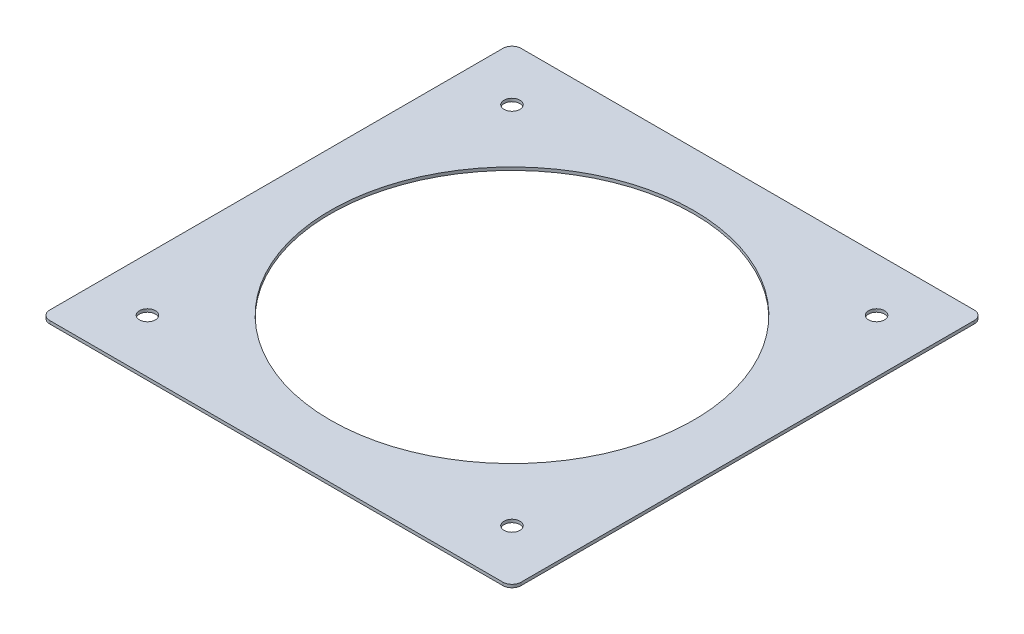
ISO-10303-21;
HEADER;
FILE_DESCRIPTION(('STEP AP214'),'2;1');
FILE_NAME('part.step','',(''),(''),'','','');
FILE_SCHEMA(('AUTOMOTIVE_DESIGN { 1 0 10303 214 1 1 1 1 }'));
ENDSEC;
DATA;
#1=APPLICATION_CONTEXT('core data for automotive mechanical design processes');
#2=APPLICATION_PROTOCOL_DEFINITION('international standard','automotive_design',2000,#1);
#3=PRODUCT_CONTEXT('',#1,'mechanical');
#4=PRODUCT('Part','Part','',(#3));
#5=PRODUCT_RELATED_PRODUCT_CATEGORY('part','',(#4));
#6=PRODUCT_DEFINITION_FORMATION('','',#4);
#7=PRODUCT_DEFINITION_CONTEXT('part definition',#1,'design');
#8=PRODUCT_DEFINITION('design','',#6,#7);
#9=PRODUCT_DEFINITION_SHAPE('','',#8);
#10=(LENGTH_UNIT() NAMED_UNIT(*) SI_UNIT(.MILLI.,.METRE.));
#11=(NAMED_UNIT(*) PLANE_ANGLE_UNIT() SI_UNIT($,.RADIAN.));
#12=(NAMED_UNIT(*) SI_UNIT($,.STERADIAN.) SOLID_ANGLE_UNIT());
#13=UNCERTAINTY_MEASURE_WITH_UNIT(LENGTH_MEASURE(1.E-05),#10,'distance_accuracy_value','');
#14=(GEOMETRIC_REPRESENTATION_CONTEXT(3) GLOBAL_UNCERTAINTY_ASSIGNED_CONTEXT((#13)) GLOBAL_UNIT_ASSIGNED_CONTEXT((#10,
#11,#12)) REPRESENTATION_CONTEXT('',''));
#15=CARTESIAN_POINT('',(0.,0.,0.));
#16=DIRECTION('',(0.,0.,1.));
#17=DIRECTION('',(1.,0.,0.));
#18=AXIS2_PLACEMENT_3D('',#15,#16,#17);
#19=CARTESIAN_POINT('',(77.4590674313275,1.,0.));
#20=DIRECTION('',(-1.,0.,0.));
#21=DIRECTION('',(0.,0.,1.));
#22=AXIS2_PLACEMENT_3D('',#19,#20,#21);
#23=PLANE('',#22);
#24=DIRECTION('',(0.,0.,-1.));
#25=VECTOR('',#24,1.);
#26=CARTESIAN_POINT('',(77.4590674313275,0.,0.));
#27=LINE('',#26,#25);
#28=CARTESIAN_POINT('',(77.4590674313275,0.,74.0531285438933));
#29=VERTEX_POINT('',#28);
#30=CARTESIAN_POINT('',(77.4590674313275,0.,-75.6224732138146));
#31=VERTEX_POINT('',#30);
#32=EDGE_CURVE('E155',#29,#31,#27,.T.);
#33=ORIENTED_EDGE('',*,*,#32,.T.);
#34=DIRECTION('',(0.,-1.,0.));
#35=VECTOR('',#34,1.);
#36=CARTESIAN_POINT('',(77.4590674313275,1.,-75.6224732138146));
#37=LINE('',#36,#35);
#38=CARTESIAN_POINT('',(77.4590674313275,1.,-75.6224732138146));
#39=VERTEX_POINT('',#38);
#40=EDGE_CURVE('E11',#39,#31,#37,.T.);
#41=ORIENTED_EDGE('',*,*,#40,.F.);
#42=DIRECTION('',(0.,0.,-1.));
#43=VECTOR('',#42,1.);
#44=CARTESIAN_POINT('',(77.4590674313275,1.,0.));
#45=LINE('',#44,#43);
#46=CARTESIAN_POINT('',(77.4590674313275,1.,74.0531285438933));
#47=VERTEX_POINT('',#46);
#48=EDGE_CURVE('E208',#47,#39,#45,.T.);
#49=ORIENTED_EDGE('',*,*,#48,.F.);
#50=DIRECTION('',(0.,-1.,0.));
#51=VECTOR('',#50,1.);
#52=CARTESIAN_POINT('',(77.4590674313275,1.,74.0531285438933));
#53=LINE('',#52,#51);
#54=EDGE_CURVE('E145',#47,#29,#53,.T.);
#55=ORIENTED_EDGE('',*,*,#54,.T.);
#56=EDGE_LOOP('',(#33,#41,#49,#55));
#57=FACE_BOUND('',#56,.T.);
#58=ADVANCED_FACE('F42',(#57),#23,.F.);
#59=CARTESIAN_POINT('',(74.4454647113736,1.,-75.6224732138146));
#60=DIRECTION('',(0.,-1.,0.));
#61=DIRECTION('',(0.,0.,-1.));
#62=AXIS2_PLACEMENT_3D('',#59,#60,#61);
#63=CYLINDRICAL_SURFACE('',#62,3.01360271995386);
#64=CARTESIAN_POINT('',(74.4454647113736,0.,-75.6224732138146));
#65=DIRECTION('',(0.,1.,0.));
#66=DIRECTION('',(0.,0.,1.));
#67=AXIS2_PLACEMENT_3D('',#64,#65,#66);
#68=CIRCLE('',#67,3.01360271995386);
#69=CARTESIAN_POINT('',(74.4454647113736,0.,-78.6360759337684));
#70=VERTEX_POINT('',#69);
#71=EDGE_CURVE('E158',#31,#70,#68,.T.);
#72=ORIENTED_EDGE('',*,*,#71,.T.);
#73=DIRECTION('',(0.,-1.,0.));
#74=VECTOR('',#73,1.);
#75=CARTESIAN_POINT('',(74.4454647113736,1.,-78.6360759337684));
#76=LINE('',#75,#74);
#77=CARTESIAN_POINT('',(74.4454647113736,1.,-78.6360759337684));
#78=VERTEX_POINT('',#77);
#79=EDGE_CURVE('E51',#78,#70,#76,.T.);
#80=ORIENTED_EDGE('',*,*,#79,.F.);
#81=CARTESIAN_POINT('',(74.4454647113736,1.,-75.6224732138146));
#82=DIRECTION('',(0.,1.,0.));
#83=DIRECTION('',(0.,0.,1.));
#84=AXIS2_PLACEMENT_3D('',#81,#82,#83);
#85=CIRCLE('',#84,3.01360271995386);
#86=EDGE_CURVE('E102',#39,#78,#85,.T.);
#87=ORIENTED_EDGE('',*,*,#86,.F.);
#88=ORIENTED_EDGE('',*,*,#40,.T.);
#89=EDGE_LOOP('',(#72,#80,#87,#88));
#90=FACE_BOUND('',#89,.T.);
#91=ADVANCED_FACE('F245',(#90),#63,.T.);
#92=CARTESIAN_POINT('',(0.,1.,-78.6360759337684));
#93=DIRECTION('',(0.,0.,1.));
#94=DIRECTION('',(1.,0.,0.));
#95=AXIS2_PLACEMENT_3D('',#92,#93,#94);
#96=PLANE('',#95);
#97=DIRECTION('',(-1.,0.,0.));
#98=VECTOR('',#97,1.);
#99=CARTESIAN_POINT('',(0.,0.,-78.6360759337684));
#100=LINE('',#99,#98);
#101=CARTESIAN_POINT('',(-75.2301370463343,0.,-78.6360759337684));
#102=VERTEX_POINT('',#101);
#103=EDGE_CURVE('E160',#70,#102,#100,.T.);
#104=ORIENTED_EDGE('',*,*,#103,.T.);
#105=DIRECTION('',(0.,-1.,0.));
#106=VECTOR('',#105,1.);
#107=CARTESIAN_POINT('',(-75.2301370463343,1.,-78.6360759337684));
#108=LINE('',#107,#106);
#109=CARTESIAN_POINT('',(-75.2301370463343,1.,-78.6360759337684));
#110=VERTEX_POINT('',#109);
#111=EDGE_CURVE('E182',#110,#102,#108,.T.);
#112=ORIENTED_EDGE('',*,*,#111,.F.);
#113=DIRECTION('',(-1.,0.,0.));
#114=VECTOR('',#113,1.);
#115=CARTESIAN_POINT('',(0.,1.,-78.6360759337684));
#116=LINE('',#115,#114);
#117=EDGE_CURVE('E190',#78,#110,#116,.T.);
#118=ORIENTED_EDGE('',*,*,#117,.F.);
#119=ORIENTED_EDGE('',*,*,#79,.T.);
#120=EDGE_LOOP('',(#104,#112,#118,#119));
#121=FACE_BOUND('',#120,.T.);
#122=ADVANCED_FACE('F188',(#121),#96,.F.);
#123=CARTESIAN_POINT('',(-75.2301370463343,1.,-75.6224732138146));
#124=DIRECTION('',(0.,-1.,0.));
#125=DIRECTION('',(0.,0.,-1.));
#126=AXIS2_PLACEMENT_3D('',#123,#124,#125);
#127=CYLINDRICAL_SURFACE('',#126,3.01360271995386);
#128=CARTESIAN_POINT('',(-75.2301370463343,0.,-75.6224732138146));
#129=DIRECTION('',(0.,1.,0.));
#130=DIRECTION('',(0.,0.,1.));
#131=AXIS2_PLACEMENT_3D('',#128,#129,#130);
#132=CIRCLE('',#131,3.01360271995386);
#133=CARTESIAN_POINT('',(-78.2437397662881,0.,-75.6224732138146));
#134=VERTEX_POINT('',#133);
#135=EDGE_CURVE('E162',#102,#134,#132,.T.);
#136=ORIENTED_EDGE('',*,*,#135,.T.);
#137=DIRECTION('',(0.,-1.,0.));
#138=VECTOR('',#137,1.);
#139=CARTESIAN_POINT('',(-78.2437397662881,1.,-75.6224732138146));
#140=LINE('',#139,#138);
#141=CARTESIAN_POINT('',(-78.2437397662881,1.,-75.6224732138146));
#142=VERTEX_POINT('',#141);
#143=EDGE_CURVE('E179',#142,#134,#140,.T.);
#144=ORIENTED_EDGE('',*,*,#143,.F.);
#145=CARTESIAN_POINT('',(-75.2301370463343,1.,-75.6224732138146));
#146=DIRECTION('',(0.,1.,0.));
#147=DIRECTION('',(0.,0.,1.));
#148=AXIS2_PLACEMENT_3D('',#145,#146,#147);
#149=CIRCLE('',#148,3.01360271995386);
#150=EDGE_CURVE('E203',#110,#142,#149,.T.);
#151=ORIENTED_EDGE('',*,*,#150,.F.);
#152=ORIENTED_EDGE('',*,*,#111,.T.);
#153=EDGE_LOOP('',(#136,#144,#151,#152));
#154=FACE_BOUND('',#153,.T.);
#155=ADVANCED_FACE('F199',(#154),#127,.T.);
#156=CARTESIAN_POINT('',(-78.2437397662881,1.,0.));
#157=DIRECTION('',(1.,0.,0.));
#158=DIRECTION('',(0.,0.,-1.));
#159=AXIS2_PLACEMENT_3D('',#156,#157,#158);
#160=PLANE('',#159);
#161=DIRECTION('',(0.,0.,1.));
#162=VECTOR('',#161,1.);
#163=CARTESIAN_POINT('',(-78.2437397662881,0.,0.));
#164=LINE('',#163,#162);
#165=CARTESIAN_POINT('',(-78.2437397662881,0.,74.0531285438933));
#166=VERTEX_POINT('',#165);
#167=EDGE_CURVE('E164',#134,#166,#164,.T.);
#168=ORIENTED_EDGE('',*,*,#167,.T.);
#169=DIRECTION('',(0.,-1.,0.));
#170=VECTOR('',#169,1.);
#171=CARTESIAN_POINT('',(-78.2437397662881,1.,74.0531285438933));
#172=LINE('',#171,#170);
#173=CARTESIAN_POINT('',(-78.2437397662881,1.,74.0531285438933));
#174=VERTEX_POINT('',#173);
#175=EDGE_CURVE('E131',#174,#166,#172,.T.);
#176=ORIENTED_EDGE('',*,*,#175,.F.);
#177=DIRECTION('',(0.,0.,1.));
#178=VECTOR('',#177,1.);
#179=CARTESIAN_POINT('',(-78.2437397662881,1.,0.));
#180=LINE('',#179,#178);
#181=EDGE_CURVE('E122',#142,#174,#180,.T.);
#182=ORIENTED_EDGE('',*,*,#181,.F.);
#183=ORIENTED_EDGE('',*,*,#143,.T.);
#184=EDGE_LOOP('',(#168,#176,#182,#183));
#185=FACE_BOUND('',#184,.T.);
#186=ADVANCED_FACE('F202',(#185),#160,.F.);
#187=CARTESIAN_POINT('',(-75.2301370463343,1.,74.0531285438933));
#188=DIRECTION('',(0.,-1.,0.));
#189=DIRECTION('',(0.,0.,-1.));
#190=AXIS2_PLACEMENT_3D('',#187,#188,#189);
#191=CYLINDRICAL_SURFACE('',#190,3.01360271995385);
#192=CARTESIAN_POINT('',(-75.2301370463343,0.,74.0531285438933));
#193=DIRECTION('',(0.,1.,0.));
#194=DIRECTION('',(0.,0.,1.));
#195=AXIS2_PLACEMENT_3D('',#192,#193,#194);
#196=CIRCLE('',#195,3.01360271995385);
#197=CARTESIAN_POINT('',(-75.2301370463343,0.,77.0667312638472));
#198=VERTEX_POINT('',#197);
#199=EDGE_CURVE('E130',#166,#198,#196,.T.);
#200=ORIENTED_EDGE('',*,*,#199,.T.);
#201=DIRECTION('',(0.,-1.,0.));
#202=VECTOR('',#201,1.);
#203=CARTESIAN_POINT('',(-75.2301370463343,1.,77.0667312638472));
#204=LINE('',#203,#202);
#205=CARTESIAN_POINT('',(-75.2301370463343,1.,77.0667312638472));
#206=VERTEX_POINT('',#205);
#207=EDGE_CURVE('E127',#206,#198,#204,.T.);
#208=ORIENTED_EDGE('',*,*,#207,.F.);
#209=CARTESIAN_POINT('',(-75.2301370463343,1.,74.0531285438933));
#210=DIRECTION('',(0.,1.,0.));
#211=DIRECTION('',(0.,0.,1.));
#212=AXIS2_PLACEMENT_3D('',#209,#210,#211);
#213=CIRCLE('',#212,3.01360271995385);
#214=EDGE_CURVE('E115',#174,#206,#213,.T.);
#215=ORIENTED_EDGE('',*,*,#214,.F.);
#216=ORIENTED_EDGE('',*,*,#175,.T.);
#217=EDGE_LOOP('',(#200,#208,#215,#216));
#218=FACE_BOUND('',#217,.T.);
#219=ADVANCED_FACE('F128',(#218),#191,.T.);
#220=CARTESIAN_POINT('',(0.,1.,77.0667312638472));
#221=DIRECTION('',(0.,0.,-1.));
#222=DIRECTION('',(-1.,0.,0.));
#223=AXIS2_PLACEMENT_3D('',#220,#221,#222);
#224=PLANE('',#223);
#225=DIRECTION('',(1.,0.,0.));
#226=VECTOR('',#225,1.);
#227=CARTESIAN_POINT('',(0.,0.,77.0667312638472));
#228=LINE('',#227,#226);
#229=CARTESIAN_POINT('',(74.4454647113736,0.,77.0667312638472));
#230=VERTEX_POINT('',#229);
#231=EDGE_CURVE('E88',#198,#230,#228,.T.);
#232=ORIENTED_EDGE('',*,*,#231,.T.);
#233=DIRECTION('',(0.,-1.,0.));
#234=VECTOR('',#233,1.);
#235=CARTESIAN_POINT('',(74.4454647113736,1.,77.0667312638472));
#236=LINE('',#235,#234);
#237=CARTESIAN_POINT('',(74.4454647113736,1.,77.0667312638472));
#238=VERTEX_POINT('',#237);
#239=EDGE_CURVE('E132',#238,#230,#236,.T.);
#240=ORIENTED_EDGE('',*,*,#239,.F.);
#241=DIRECTION('',(1.,0.,0.));
#242=VECTOR('',#241,1.);
#243=CARTESIAN_POINT('',(0.,1.,77.0667312638472));
#244=LINE('',#243,#242);
#245=EDGE_CURVE('E120',#206,#238,#244,.T.);
#246=ORIENTED_EDGE('',*,*,#245,.F.);
#247=ORIENTED_EDGE('',*,*,#207,.T.);
#248=EDGE_LOOP('',(#232,#240,#246,#247));
#249=FACE_BOUND('',#248,.T.);
#250=ADVANCED_FACE('F134',(#249),#224,.F.);
#251=CARTESIAN_POINT('',(59.8214251180902,1.,59.42908895061));
#252=DIRECTION('',(0.,-1.,0.));
#253=DIRECTION('',(0.,0.,-1.));
#254=AXIS2_PLACEMENT_3D('',#251,#252,#253);
#255=CYLINDRICAL_SURFACE('',#254,2.63764231323723);
#256=CARTESIAN_POINT('',(59.8214251180902,1.,59.42908895061));
#257=DIRECTION('',(0.,1.,0.));
#258=DIRECTION('',(0.,0.,1.));
#259=AXIS2_PLACEMENT_3D('',#256,#257,#258);
#260=CIRCLE('',#259,2.63764231323723);
#261=CARTESIAN_POINT('',(59.8214251180902,1.,62.0667312638472));
#262=VERTEX_POINT('',#261);
#263=EDGE_CURVE('E136',#262,#262,#260,.T.);
#264=ORIENTED_EDGE('',*,*,#263,.T.);
#265=EDGE_LOOP('',(#264));
#266=FACE_BOUND('',#265,.T.);
#267=CARTESIAN_POINT('',(59.8214251180902,0.,59.42908895061));
#268=DIRECTION('',(0.,1.,0.));
#269=DIRECTION('',(0.,0.,1.));
#270=AXIS2_PLACEMENT_3D('',#267,#268,#269);
#271=CIRCLE('',#270,2.63764231323723);
#272=CARTESIAN_POINT('',(59.8214251180902,0.,62.0667312638472));
#273=VERTEX_POINT('',#272);
#274=EDGE_CURVE('E169',#273,#273,#271,.T.);
#275=ORIENTED_EDGE('',*,*,#274,.F.);
#276=EDGE_LOOP('',(#275));
#277=FACE_BOUND('',#276,.T.);
#278=ADVANCED_FACE('F269',(#266,#277),#255,.F.);
#279=CARTESIAN_POINT('',(74.4454647113736,1.,74.0531285438933));
#280=DIRECTION('',(0.,-1.,0.));
#281=DIRECTION('',(0.,0.,-1.));
#282=AXIS2_PLACEMENT_3D('',#279,#280,#281);
#283=CYLINDRICAL_SURFACE('',#282,3.01360271995386);
#284=CARTESIAN_POINT('',(74.4454647113736,0.,74.0531285438933));
#285=DIRECTION('',(0.,1.,0.));
#286=DIRECTION('',(0.,0.,1.));
#287=AXIS2_PLACEMENT_3D('',#284,#285,#286);
#288=CIRCLE('',#287,3.01360271995386);
#289=EDGE_CURVE('E94',#230,#29,#288,.T.);
#290=ORIENTED_EDGE('',*,*,#289,.T.);
#291=ORIENTED_EDGE('',*,*,#54,.F.);
#292=CARTESIAN_POINT('',(74.4454647113736,1.,74.0531285438933));
#293=DIRECTION('',(0.,1.,0.));
#294=DIRECTION('',(0.,0.,1.));
#295=AXIS2_PLACEMENT_3D('',#292,#293,#294);
#296=CIRCLE('',#295,3.01360271995386);
#297=EDGE_CURVE('E59',#238,#47,#296,.T.);
#298=ORIENTED_EDGE('',*,*,#297,.F.);
#299=ORIENTED_EDGE('',*,*,#239,.T.);
#300=EDGE_LOOP('',(#290,#291,#298,#299));
#301=FACE_BOUND('',#300,.T.);
#302=ADVANCED_FACE('F233',(#301),#283,.T.);
#303=CARTESIAN_POINT('',(-60.6060974530509,1.,-60.9984336205312));
#304=DIRECTION('',(0.,-1.,0.));
#305=DIRECTION('',(0.,0.,-1.));
#306=AXIS2_PLACEMENT_3D('',#303,#304,#305);
#307=CYLINDRICAL_SURFACE('',#306,2.63764231323724);
#308=CARTESIAN_POINT('',(-60.6060974530509,1.,-60.9984336205312));
#309=DIRECTION('',(0.,1.,0.));
#310=DIRECTION('',(0.,0.,1.));
#311=AXIS2_PLACEMENT_3D('',#308,#309,#310);
#312=CIRCLE('',#311,2.63764231323724);
#313=CARTESIAN_POINT('',(-60.6060974530509,1.,-58.360791307294));
#314=VERTEX_POINT('',#313);
#315=EDGE_CURVE('E210',#314,#314,#312,.T.);
#316=ORIENTED_EDGE('',*,*,#315,.T.);
#317=EDGE_LOOP('',(#316));
#318=FACE_BOUND('',#317,.T.);
#319=CARTESIAN_POINT('',(-60.6060974530509,0.,-60.9984336205312));
#320=DIRECTION('',(0.,1.,0.));
#321=DIRECTION('',(0.,0.,1.));
#322=AXIS2_PLACEMENT_3D('',#319,#320,#321);
#323=CIRCLE('',#322,2.63764231323724);
#324=CARTESIAN_POINT('',(-60.6060974530509,0.,-58.360791307294));
#325=VERTEX_POINT('',#324);
#326=EDGE_CURVE('E152',#325,#325,#323,.T.);
#327=ORIENTED_EDGE('',*,*,#326,.F.);
#328=EDGE_LOOP('',(#327));
#329=FACE_BOUND('',#328,.T.);
#330=ADVANCED_FACE('F229',(#318,#329),#307,.F.);
#331=CARTESIAN_POINT('',(-60.6060974530509,1.,59.4290889506099));
#332=DIRECTION('',(0.,-1.,0.));
#333=DIRECTION('',(0.,0.,-1.));
#334=AXIS2_PLACEMENT_3D('',#331,#332,#333);
#335=CYLINDRICAL_SURFACE('',#334,2.63764231323724);
#336=CARTESIAN_POINT('',(-60.6060974530509,1.,59.4290889506099));
#337=DIRECTION('',(0.,1.,0.));
#338=DIRECTION('',(0.,0.,1.));
#339=AXIS2_PLACEMENT_3D('',#336,#337,#338);
#340=CIRCLE('',#339,2.63764231323724);
#341=CARTESIAN_POINT('',(-60.6060974530509,1.,62.0667312638472));
#342=VERTEX_POINT('',#341);
#343=EDGE_CURVE('E213',#342,#342,#340,.F.);
#344=ORIENTED_EDGE('',*,*,#343,.F.);
#345=EDGE_LOOP('',(#344));
#346=FACE_BOUND('',#345,.T.);
#347=CARTESIAN_POINT('',(-60.6060974530509,0.,59.4290889506099));
#348=DIRECTION('',(0.,1.,0.));
#349=DIRECTION('',(0.,0.,1.));
#350=AXIS2_PLACEMENT_3D('',#347,#348,#349);
#351=CIRCLE('',#350,2.63764231323724);
#352=CARTESIAN_POINT('',(-60.6060974530509,0.,62.0667312638472));
#353=VERTEX_POINT('',#352);
#354=EDGE_CURVE('E149',#353,#353,#351,.F.);
#355=ORIENTED_EDGE('',*,*,#354,.T.);
#356=EDGE_LOOP('',(#355));
#357=FACE_BOUND('',#356,.T.);
#358=ADVANCED_FACE('F232',(#346,#357),#335,.F.);
#359=CARTESIAN_POINT('',(-0.392336167480328,1.,-0.784672334960622));
#360=DIRECTION('',(0.,-1.,0.));
#361=DIRECTION('',(0.,0.,-1.));
#362=AXIS2_PLACEMENT_3D('',#359,#360,#361);
#363=CYLINDRICAL_SURFACE('',#362,60.);
#364=CARTESIAN_POINT('',(-0.392336167480328,1.,-0.784672334960622));
#365=DIRECTION('',(0.,1.,0.));
#366=DIRECTION('',(0.,0.,1.));
#367=AXIS2_PLACEMENT_3D('',#364,#365,#366);
#368=CIRCLE('',#367,60.);
#369=CARTESIAN_POINT('',(-0.392336167480328,1.,59.2153276650394));
#370=VERTEX_POINT('',#369);
#371=EDGE_CURVE('E175',#370,#370,#368,.T.);
#372=ORIENTED_EDGE('',*,*,#371,.T.);
#373=EDGE_LOOP('',(#372));
#374=FACE_BOUND('',#373,.T.);
#375=CARTESIAN_POINT('',(-0.392336167480328,0.,-0.784672334960622));
#376=DIRECTION('',(0.,1.,0.));
#377=DIRECTION('',(0.,0.,1.));
#378=AXIS2_PLACEMENT_3D('',#375,#376,#377);
#379=CIRCLE('',#378,60.);
#380=CARTESIAN_POINT('',(-0.392336167480328,0.,59.2153276650394));
#381=VERTEX_POINT('',#380);
#382=EDGE_CURVE('E146',#381,#381,#379,.T.);
#383=ORIENTED_EDGE('',*,*,#382,.F.);
#384=EDGE_LOOP('',(#383));
#385=FACE_BOUND('',#384,.T.);
#386=ADVANCED_FACE('F44',(#374,#385),#363,.F.);
#387=CARTESIAN_POINT('',(59.8214251180902,1.,-60.9984336205312));
#388=DIRECTION('',(0.,-1.,0.));
#389=DIRECTION('',(0.,0.,-1.));
#390=AXIS2_PLACEMENT_3D('',#387,#388,#389);
#391=CYLINDRICAL_SURFACE('',#390,2.63764231323724);
#392=CARTESIAN_POINT('',(59.8214251180902,1.,-60.9984336205312));
#393=DIRECTION('',(0.,1.,0.));
#394=DIRECTION('',(0.,0.,1.));
#395=AXIS2_PLACEMENT_3D('',#392,#393,#394);
#396=CIRCLE('',#395,2.63764231323724);
#397=CARTESIAN_POINT('',(59.8214251180902,1.,-58.360791307294));
#398=VERTEX_POINT('',#397);
#399=EDGE_CURVE('E142',#398,#398,#396,.F.);
#400=ORIENTED_EDGE('',*,*,#399,.F.);
#401=EDGE_LOOP('',(#400));
#402=FACE_BOUND('',#401,.T.);
#403=CARTESIAN_POINT('',(59.8214251180902,0.,-60.9984336205312));
#404=DIRECTION('',(0.,1.,0.));
#405=DIRECTION('',(0.,0.,1.));
#406=AXIS2_PLACEMENT_3D('',#403,#404,#405);
#407=CIRCLE('',#406,2.63764231323724);
#408=CARTESIAN_POINT('',(59.8214251180902,0.,-58.360791307294));
#409=VERTEX_POINT('',#408);
#410=EDGE_CURVE('E172',#409,#409,#407,.F.);
#411=ORIENTED_EDGE('',*,*,#410,.T.);
#412=EDGE_LOOP('',(#411));
#413=FACE_BOUND('',#412,.T.);
#414=ADVANCED_FACE('F223',(#402,#413),#391,.F.);
#415=CARTESIAN_POINT('',(0.,1.,0.));
#416=DIRECTION('',(0.,1.,0.));
#417=DIRECTION('',(0.,0.,1.));
#418=AXIS2_PLACEMENT_3D('',#415,#416,#417);
#419=PLANE('',#418);
#420=ORIENTED_EDGE('',*,*,#371,.F.);
#421=EDGE_LOOP('',(#420));
#422=FACE_BOUND('',#421,.T.);
#423=ORIENTED_EDGE('',*,*,#343,.T.);
#424=EDGE_LOOP('',(#423));
#425=FACE_BOUND('',#424,.T.);
#426=ORIENTED_EDGE('',*,*,#315,.F.);
#427=EDGE_LOOP('',(#426));
#428=FACE_BOUND('',#427,.T.);
#429=ORIENTED_EDGE('',*,*,#48,.T.);
#430=ORIENTED_EDGE('',*,*,#86,.T.);
#431=ORIENTED_EDGE('',*,*,#117,.T.);
#432=ORIENTED_EDGE('',*,*,#150,.T.);
#433=ORIENTED_EDGE('',*,*,#181,.T.);
#434=ORIENTED_EDGE('',*,*,#214,.T.);
#435=ORIENTED_EDGE('',*,*,#245,.T.);
#436=ORIENTED_EDGE('',*,*,#297,.T.);
#437=EDGE_LOOP('',(#429,#430,#431,#432,#433,#434,#435,#436));
#438=FACE_BOUND('',#437,.T.);
#439=ORIENTED_EDGE('',*,*,#263,.F.);
#440=EDGE_LOOP('',(#439));
#441=FACE_BOUND('',#440,.T.);
#442=ORIENTED_EDGE('',*,*,#399,.T.);
#443=EDGE_LOOP('',(#442));
#444=FACE_BOUND('',#443,.T.);
#445=ADVANCED_FACE('F117',(#422,#425,#428,#438,#441,#444),#419,.T.);
#446=CARTESIAN_POINT('',(0.,0.,0.));
#447=DIRECTION('',(0.,1.,0.));
#448=DIRECTION('',(0.,0.,1.));
#449=AXIS2_PLACEMENT_3D('',#446,#447,#448);
#450=PLANE('',#449);
#451=ORIENTED_EDGE('',*,*,#382,.T.);
#452=EDGE_LOOP('',(#451));
#453=FACE_BOUND('',#452,.T.);
#454=ORIENTED_EDGE('',*,*,#354,.F.);
#455=EDGE_LOOP('',(#454));
#456=FACE_BOUND('',#455,.T.);
#457=ORIENTED_EDGE('',*,*,#326,.T.);
#458=EDGE_LOOP('',(#457));
#459=FACE_BOUND('',#458,.T.);
#460=ORIENTED_EDGE('',*,*,#32,.F.);
#461=ORIENTED_EDGE('',*,*,#289,.F.);
#462=ORIENTED_EDGE('',*,*,#231,.F.);
#463=ORIENTED_EDGE('',*,*,#199,.F.);
#464=ORIENTED_EDGE('',*,*,#167,.F.);
#465=ORIENTED_EDGE('',*,*,#135,.F.);
#466=ORIENTED_EDGE('',*,*,#103,.F.);
#467=ORIENTED_EDGE('',*,*,#71,.F.);
#468=EDGE_LOOP('',(#460,#461,#462,#463,#464,#465,#466,#467));
#469=FACE_BOUND('',#468,.T.);
#470=ORIENTED_EDGE('',*,*,#274,.T.);
#471=EDGE_LOOP('',(#470));
#472=FACE_BOUND('',#471,.T.);
#473=ORIENTED_EDGE('',*,*,#410,.F.);
#474=EDGE_LOOP('',(#473));
#475=FACE_BOUND('',#474,.T.);
#476=ADVANCED_FACE('F194',(#453,#456,#459,#469,#472,#475),#450,.F.);
#477=CLOSED_SHELL('',(#58,#91,#122,#155,#186,#219,#250,#278,#302,#330,#358,#386,#414,#445,#476));
#478=MANIFOLD_SOLID_BREP('B2',#477);
#479=ADVANCED_BREP_SHAPE_REPRESENTATION('',(#18,#478),#14);
#480=SHAPE_DEFINITION_REPRESENTATION(#9,#479);
ENDSEC;
END-ISO-10303-21;
